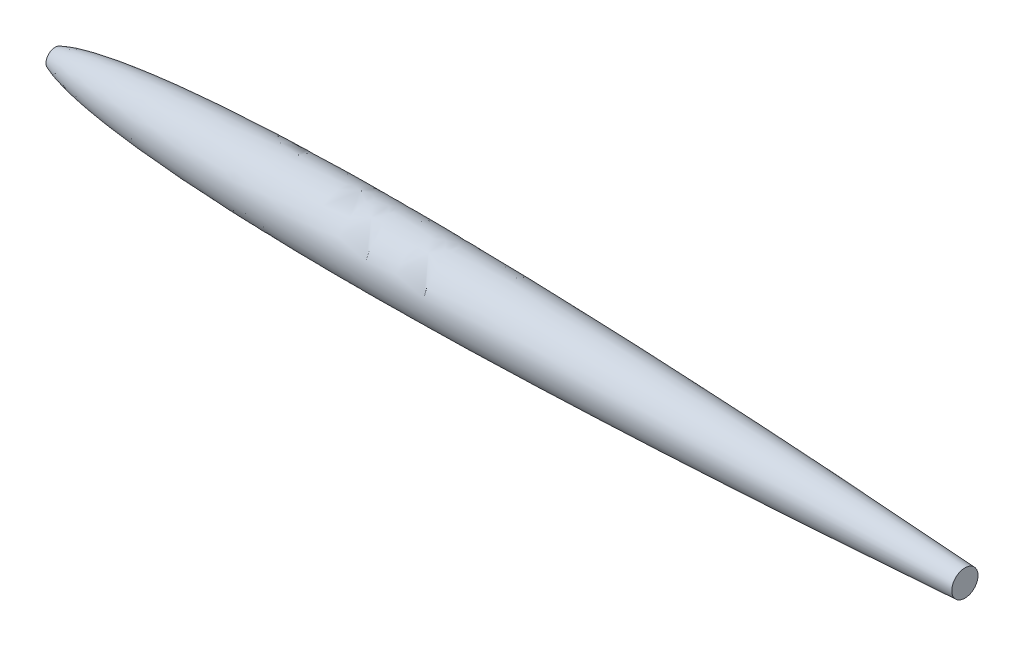
ISO-10303-21;
HEADER;
FILE_DESCRIPTION(('STEP AP214'),'2;1');
FILE_NAME('part.step','',(''),(''),'','','');
FILE_SCHEMA(('AUTOMOTIVE_DESIGN { 1 0 10303 214 1 1 1 1 }'));
ENDSEC;
DATA;
#1=APPLICATION_CONTEXT('core data for automotive mechanical design processes');
#2=APPLICATION_PROTOCOL_DEFINITION('international standard','automotive_design',2000,#1);
#3=PRODUCT_CONTEXT('',#1,'mechanical');
#4=PRODUCT('Part','Part','',(#3));
#5=PRODUCT_RELATED_PRODUCT_CATEGORY('part','',(#4));
#6=PRODUCT_DEFINITION_FORMATION('','',#4);
#7=PRODUCT_DEFINITION_CONTEXT('part definition',#1,'design');
#8=PRODUCT_DEFINITION('design','',#6,#7);
#9=PRODUCT_DEFINITION_SHAPE('','',#8);
#10=(LENGTH_UNIT() NAMED_UNIT(*) SI_UNIT(.MILLI.,.METRE.));
#11=(NAMED_UNIT(*) PLANE_ANGLE_UNIT() SI_UNIT($,.RADIAN.));
#12=(NAMED_UNIT(*) SI_UNIT($,.STERADIAN.) SOLID_ANGLE_UNIT());
#13=UNCERTAINTY_MEASURE_WITH_UNIT(LENGTH_MEASURE(1.E-05),#10,'distance_accuracy_value','');
#14=(GEOMETRIC_REPRESENTATION_CONTEXT(3) GLOBAL_UNCERTAINTY_ASSIGNED_CONTEXT((#13)) GLOBAL_UNIT_ASSIGNED_CONTEXT((#10,
#11,#12)) REPRESENTATION_CONTEXT('',''));
#15=CARTESIAN_POINT('',(0.,0.,0.));
#16=DIRECTION('',(0.,0.,1.));
#17=DIRECTION('',(1.,0.,0.));
#18=AXIS2_PLACEMENT_3D('',#15,#16,#17);
#19=CARTESIAN_POINT('',(10999.9999999114,0.,-6.43708127694486E-09));
#20=CARTESIAN_POINT('',(10993.9727306901,0.,-0.438031797088573));
#21=CARTESIAN_POINT('',(10981.8032504732,0.,-1.32144289600741));
#22=CARTESIAN_POINT('',(10958.8710367509,0.,-2.98352274322804));
#23=CARTESIAN_POINT('',(10934.3368481594,0.,-4.75453023288062));
#24=CARTESIAN_POINT('',(10900.2084233248,0.,-7.21234567680039));
#25=CARTESIAN_POINT('',(10861.0394153717,0.,-10.0201321720221));
#26=CARTESIAN_POINT('',(10814.2581571265,0.,-13.3575019726778));
#27=CARTESIAN_POINT('',(10761.4535922365,0.,-17.1003804288576));
#28=CARTESIAN_POINT('',(10708.2897318897,0.,-20.8462837145694));
#29=CARTESIAN_POINT('',(10655.3329451982,0.,-24.5542716647989));
#30=CARTESIAN_POINT('',(10602.249493916,0.,-28.248814521459));
#31=CARTESIAN_POINT('',(10549.2401673054,0.,-31.9155308261855));
#32=CARTESIAN_POINT('',(10496.1834192708,0.,-35.5634599237538));
#33=CARTESIAN_POINT('',(10443.1529904408,0.,-39.1874437503906));
#34=CARTESIAN_POINT('',(10390.1042798018,0.,-42.7909197834185));
#35=CARTESIAN_POINT('',(10337.0641434928,0.,-46.3721273641647));
#36=CARTESIAN_POINT('',(10284.0167615835,0.,-49.9324023741986));
#37=CARTESIAN_POINT('',(10230.9710465342,0.,-53.4712782182235));
#38=CARTESIAN_POINT('',(10138.1363511123,0.,-59.6277238807782));
#39=CARTESIAN_POINT('',(10032.0349969403,0.,-66.5802700900151));
#40=CARTESIAN_POINT('',(9912.66332687831,0.,-74.2947340481952));
#41=CARTESIAN_POINT('',(9780.0200085779,0.,-82.7330976147289));
#42=CARTESIAN_POINT('',(9673.90020370212,0.,-89.4049347782293));
#43=CARTESIAN_POINT('',(9541.24447252994,0.,-97.6473828977432));
#44=CARTESIAN_POINT('',(9382.04802790126,0.,-107.384401539987));
#45=CARTESIAN_POINT('',(9196.30547929109,0.,-118.523403251807));
#46=CARTESIAN_POINT('',(8984.01062255047,0.,-130.956090450395));
#47=CARTESIAN_POINT('',(8771.69878438221,0.,-143.095088026498));
#48=CARTESIAN_POINT('',(8506.28841889144,0.,-157.9048846195));
#49=CARTESIAN_POINT('',(8187.76401561209,0.,-175.096544248704));
#50=CARTESIAN_POINT('',(7816.10723978569,0.,-194.306117475576));
#51=CARTESIAN_POINT('',(7391.29684687631,0.,-215.071528970679));
#52=CARTESIAN_POINT('',(6966.42760979841,0.,-234.597307497891));
#53=CARTESIAN_POINT('',(6541.49978351588,0.,-252.805736724156));
#54=CARTESIAN_POINT('',(6116.51321361754,0.,-269.590680129271));
#55=CARTESIAN_POINT('',(5691.46768933378,0.,-284.815055747022));
#56=CARTESIAN_POINT('',(5266.36340457883,0.,-298.307410519293));
#57=CARTESIAN_POINT('',(4841.20155804878,0.,-309.857365651042));
#58=CARTESIAN_POINT('',(4415.98520152772,0.,-319.209100207951));
#59=CARTESIAN_POINT('',(3990.72040314142,0.,-326.052290467533));
#60=CARTESIAN_POINT('',(3618.58081240911,0.,-329.513768650375));
#61=CARTESIAN_POINT('',(3299.59192293651,0.,-330.384071895175));
#62=CARTESIAN_POINT('',(3033.76918605138,0.,-329.526860496355));
#63=CARTESIAN_POINT('',(2821.11671644886,0.,-327.806853246903));
#64=CARTESIAN_POINT('',(2608.47621167468,0.,-324.955727137892));
#65=CARTESIAN_POINT('',(2395.85579901899,0.,-320.860371187195));
#66=CARTESIAN_POINT('',(2183.26607259424,0.,-315.387382687774));
#67=CARTESIAN_POINT('',(1970.72108881952,0.,-308.376208713986));
#68=CARTESIAN_POINT('',(1784.82720980626,0.,-300.723903315102));
#69=CARTESIAN_POINT('',(1625.57696457262,0.,-292.926255548081));
#70=CARTESIAN_POINT('',(1492.95401596303,0.,-285.502236935934));
#71=CARTESIAN_POINT('',(1386.93458197183,0.,-278.961621427036));
#72=CARTESIAN_POINT('',(1280.95775603708,0.,-271.761542521152));
#73=CARTESIAN_POINT('',(1175.03259637474,0.,-263.835414150813));
#74=CARTESIAN_POINT('',(1069.17063551745,0.,-255.10283842246));
#75=CARTESIAN_POINT('',(963.38698087677,0.,-245.464526813153));
#76=CARTESIAN_POINT('',(859.684753542944,0.,-234.995657417139));
#77=CARTESIAN_POINT('',(758.084154260968,0.,-223.607887378711));
#78=CARTESIAN_POINT('',(658.612232457384,0.,-211.186619601166));
#79=CARTESIAN_POINT('',(573.469223953823,0.,-199.282575083875));
#80=CARTESIAN_POINT('',(500.651651232557,0.,-187.980684512054));
#81=CARTESIAN_POINT('',(439.719156268776,0.,-177.608967602177));
#82=CARTESIAN_POINT('',(390.608018363905,0.,-168.60304735642));
#83=CARTESIAN_POINT('',(341.243287096751,0.,-158.777969552616));
#84=CARTESIAN_POINT('',(291.6730044071,0.,-147.96396892893));
#85=CARTESIAN_POINT('',(243.07019996589,0.,-136.204737596919));
#86=CARTESIAN_POINT('',(201.291019257043,0.,-124.83380423951));
#87=CARTESIAN_POINT('',(166.299503436915,0.,-114.136034238537));
#88=CARTESIAN_POINT('',(137.455558774662,0.,-104.311070441166));
#89=CARTESIAN_POINT('',(113.95778562596,0.,-95.516746755885));
#90=CARTESIAN_POINT('',(92.789267204734,0.,-86.6434979617395));
#91=CARTESIAN_POINT('',(73.9829790941119,0.,-77.7242846293616));
#92=CARTESIAN_POINT('',(57.0760693623161,0.,-68.6180711546139));
#93=CARTESIAN_POINT('',(43.3840484792573,0.,-60.1943828009551));
#94=CARTESIAN_POINT('',(32.3839476203801,0.,-52.2354073372266));
#95=CARTESIAN_POINT('',(24.0065671735061,0.,-45.0124755369172));
#96=CARTESIAN_POINT('',(18.0050550905463,0.,-39.0824364753431));
#97=CARTESIAN_POINT('',(13.8073677715887,0.,-34.3714872928397));
#98=CARTESIAN_POINT('',(9.99141312001332,0.,-29.3681315340282));
#99=CARTESIAN_POINT('',(6.61089939961276,0.,-23.9643226594275));
#100=CARTESIAN_POINT('',(4.13001991638,0.,-19.1147339577008));
#101=CARTESIAN_POINT('',(2.10965681824584,0.,-13.9384587900824));
#102=CARTESIAN_POINT('',(0.673873379266392,0.,-8.45468671085863));
#103=CARTESIAN_POINT('',(0.122535706790431,0.,-4.24076673461526));
#104=CARTESIAN_POINT('',(0.000193085103623262,0.,-1.41658200533096));
#105=CARTESIAN_POINT('',(0.,0.,0.));
#106=B_SPLINE_CURVE_WITH_KNOTS('',4,(#19,#20,#21,#22,#23,#24,#25,#26,#27,#28,#29,#30,#31,#32,
#33,#34,#35,#36,#37,#38,#39,#40,#41,#42,#43,#44,#45,#46,#47,#48,#49,#50,#51,#52,#53,#54,#55,#56,
#57,#58,#59,#60,#61,#62,#63,#64,#65,#66,#67,#68,#69,#70,#71,#72,#73,#74,#75,#76,#77,#78,#79,#80,
#81,#82,#83,#84,#85,#86,#87,#88,#89,#90,#91,#92,#93,#94,#95,#96,#97,#98,#99,#100,#101,#102,#103,
#104,#105),.UNSPECIFIED.,.F.,.F.,(5,1,1,1,1,1,1,1,1,1,1,1,1,1,1,1,1,1,1,1,1,1,1,1,1,1,1,1,1,1,1,
1,1,1,1,1,1,1,1,1,1,1,1,1,1,1,1,1,1,1,1,1,1,1,1,1,1,1,1,1,1,1,1,1,1,1,1,1,1,1,1,1,1,1,1,1,1,1,1,
1,1,1,1,5),(0.,0.00218399049332629,0.00436798098665259,0.00655197147997888,0.00873596197330506,
0.0131039429599575,0.0174719239466101,0.0218399049332627,0.0262078859199152,0.0305758669065677,
0.0349438478932202,0.0393118288798728,0.0436798098665253,0.0480477908531778,0.0524157718398304,
0.056783752826483,0.0611517338131355,0.0655197147997881,0.0698876957864406,0.0873596195907531,
0.0960955814929094,0.104831543395066,0.113567505297222,0.122303467199378,0.139775391003691,
0.157247314726167,0.174719238448643,0.192191162171119,0.209663085893595,0.244606933696528,
0.279550781499461,0.314494629065929,0.349438476632398,0.384382324291439,0.419326171950479,
0.454270019603899,0.489213867257318,0.524157714808659,0.55910156236,0.59404540992135,
0.628989257482701,0.64646118120193,0.663933104921159,0.681405028640388,0.698876952359617,
0.7163488755104,0.733820798661182,0.751292721811965,0.768764644962747,0.777491660977801,
0.786218676992855,0.794945693007909,0.803672709022963,0.812399725038017,0.821126741053071,
0.829853757068125,0.83858077308318,0.846652825380427,0.854724877677674,0.862796929974921,
0.866832956123545,0.870868982272168,0.875037162263929,0.87920534225569,0.883373522247451,
0.887541702239212,0.891468997897097,0.893432645726039,0.895396293554981,0.897554586719237,
0.899712879883493,0.900973305631297,0.902233731379101,0.903863140324877,0.904992308472623,
0.905428762244265,0.905865216015906,0.906634793353248,0.907064106863914,0.90749342037458,
0.907957873985982,0.908422327597384,0.908886781208786,0.909351234820188),.UNSPECIFIED.);
#107=CARTESIAN_POINT('',(0.,0.,0.));
#108=DIRECTION('',(-1.,0.,0.));
#109=AXIS1_PLACEMENT('',#107,#108);
#110=SURFACE_OF_REVOLUTION('',#106,#109);
#111=CARTESIAN_POINT('',(100.,0.,0.));
#112=DIRECTION('',(-1.,0.,0.));
#113=DIRECTION('',(0.,0.,1.));
#114=AXIS2_PLACEMENT_3D('',#111,#112,#113);
#115=CIRCLE('',#114,89.5421719115566);
#116=CARTESIAN_POINT('',(100.,0.,89.5421719115566));
#117=VERTEX_POINT('',#116);
#118=EDGE_CURVE('E41',#117,#117,#115,.F.);
#119=ORIENTED_EDGE('',*,*,#118,.T.);
#120=EDGE_LOOP('',(#119));
#121=FACE_BOUND('',#120,.T.);
#122=CARTESIAN_POINT('',(9020.,0.,0.));
#123=DIRECTION('',(-1.,0.,0.));
#124=DIRECTION('',(0.,0.,1.));
#125=AXIS2_PLACEMENT_3D('',#122,#123,#124);
#126=CIRCLE('',#125,128.807754302869);
#127=CARTESIAN_POINT('',(9020.,0.,128.807754302869));
#128=VERTEX_POINT('',#127);
#129=EDGE_CURVE('E10',#128,#128,#126,.F.);
#130=ORIENTED_EDGE('',*,*,#129,.F.);
#131=EDGE_LOOP('',(#130));
#132=FACE_BOUND('',#131,.T.);
#133=ADVANCED_FACE('F37',(#121,#132),#110,.T.);
#134=CARTESIAN_POINT('',(9020.,0.,0.));
#135=DIRECTION('',(1.,0.,0.));
#136=DIRECTION('',(0.,0.,-1.));
#137=AXIS2_PLACEMENT_3D('',#134,#135,#136);
#138=PLANE('',#137);
#139=ORIENTED_EDGE('',*,*,#129,.T.);
#140=EDGE_LOOP('',(#139));
#141=FACE_BOUND('',#140,.T.);
#142=ADVANCED_FACE('F62',(#141),#138,.T.);
#143=CARTESIAN_POINT('',(100.,0.,0.));
#144=DIRECTION('',(1.,0.,0.));
#145=DIRECTION('',(0.,0.,-1.));
#146=AXIS2_PLACEMENT_3D('',#143,#144,#145);
#147=PLANE('',#146);
#148=ORIENTED_EDGE('',*,*,#118,.F.);
#149=EDGE_LOOP('',(#148));
#150=FACE_BOUND('',#149,.T.);
#151=ADVANCED_FACE('F60',(#150),#147,.F.);
#152=CLOSED_SHELL('',(#133,#142,#151));
#153=MANIFOLD_SOLID_BREP('B2',#152);
#154=ADVANCED_BREP_SHAPE_REPRESENTATION('',(#18,#153),#14);
#155=SHAPE_DEFINITION_REPRESENTATION(#9,#154);
ENDSEC;
END-ISO-10303-21;
